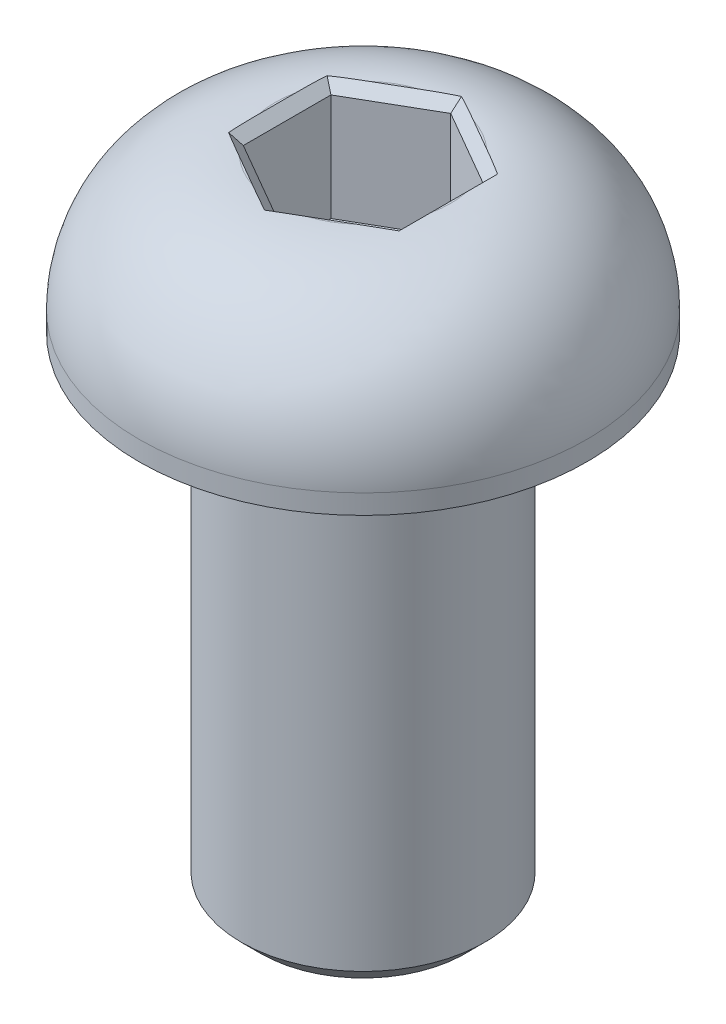
ISO-10303-21;
HEADER;
FILE_DESCRIPTION(('STEP AP214'),'2;1');
FILE_NAME('part.step','',(''),(''),'','','');
FILE_SCHEMA(('AUTOMOTIVE_DESIGN { 1 0 10303 214 1 1 1 1 }'));
ENDSEC;
DATA;
#1=APPLICATION_CONTEXT('core data for automotive mechanical design processes');
#2=APPLICATION_PROTOCOL_DEFINITION('international standard','automotive_design',2000,#1);
#3=PRODUCT_CONTEXT('',#1,'mechanical');
#4=PRODUCT('Part','Part','',(#3));
#5=PRODUCT_RELATED_PRODUCT_CATEGORY('part','',(#4));
#6=PRODUCT_DEFINITION_FORMATION('','',#4);
#7=PRODUCT_DEFINITION_CONTEXT('part definition',#1,'design');
#8=PRODUCT_DEFINITION('design','',#6,#7);
#9=PRODUCT_DEFINITION_SHAPE('','',#8);
#10=(LENGTH_UNIT() NAMED_UNIT(*) SI_UNIT(.MILLI.,.METRE.));
#11=(NAMED_UNIT(*) PLANE_ANGLE_UNIT() SI_UNIT($,.RADIAN.));
#12=(NAMED_UNIT(*) SI_UNIT($,.STERADIAN.) SOLID_ANGLE_UNIT());
#13=UNCERTAINTY_MEASURE_WITH_UNIT(LENGTH_MEASURE(1.E-05),#10,'distance_accuracy_value','');
#14=(GEOMETRIC_REPRESENTATION_CONTEXT(3) GLOBAL_UNCERTAINTY_ASSIGNED_CONTEXT((#13)) GLOBAL_UNIT_ASSIGNED_CONTEXT((#10,
#11,#12)) REPRESENTATION_CONTEXT('',''));
#15=CARTESIAN_POINT('',(0.,0.,0.));
#16=DIRECTION('',(0.,0.,1.));
#17=DIRECTION('',(1.,0.,0.));
#18=AXIS2_PLACEMENT_3D('',#15,#16,#17);
#19=CARTESIAN_POINT('',(2.23520000000001,0.,0.));
#20=DIRECTION('',(0.707106781186548,-0.707106781186548,0.));
#21=DIRECTION('',(0.707106781186548,0.707106781186548,0.));
#22=AXIS2_PLACEMENT_3D('',#19,#20,#21);
#23=PLANE('',#22);
#24=CARTESIAN_POINT('',(2.22399670617115,-0.0112032938288589,-1.28402509698474));
#25=CARTESIAN_POINT('',(2.22841135106006,-0.00678864893879202,-1.16554783242049));
#26=CARTESIAN_POINT('',(2.23110879962653,-0.00409120037287481,-1.04699639920592));
#27=CARTESIAN_POINT('',(2.23438345381033,-0.000816546190287566,-0.809850635730226));
#28=CARTESIAN_POINT('',(2.23496107929993,-0.000238920701353471,-0.691256318617618));
#29=CARTESIAN_POINT('',(2.23515898063711,-4.10193631359054E-05,-0.557099307855873));
#30=CARTESIAN_POINT('',(2.2351750070183,-2.49929817972814E-05,-0.541528977035806));
#31=CARTESIAN_POINT('',(2.23519554632668,-4.453673235457E-06,-0.510387894564967));
#32=CARTESIAN_POINT('',(2.23520005895435,5.89544553829237E-08,-0.494817142913786));
#33=CARTESIAN_POINT('',(2.23520000000001,0.,-0.479246241508439));
#34=B_SPLINE_CURVE_WITH_KNOTS('',3,(#24,#25,#26,#27,#28,#29,#30,#31,#32,#33),.UNSPECIFIED.,.F.,
.F.,(4,2,2,2,4),(0.,0.355828535544475,0.711586588509343,0.758297774785068,0.805010176248268),.UNSPECIFIED.);
#35=CARTESIAN_POINT('',(2.22399670617115,-0.0112032938288588,-1.28402509698474));
#36=VERTEX_POINT('',#35);
#37=CARTESIAN_POINT('',(2.23520000000001,0.,-0.479246241508439));
#38=VERTEX_POINT('',#37);
#39=EDGE_CURVE('E129',#36,#38,#34,.T.);
#40=ORIENTED_EDGE('',*,*,#39,.F.);
#41=DIRECTION('',(-0.654653670707975,-0.654653670707977,0.37796447300923));
#42=VECTOR('',#41,1.);
#43=CARTESIAN_POINT('',(2.22399670617115,-0.0112032938288602,-1.28402509698474));
#44=LINE('',#43,#42);
#45=CARTESIAN_POINT('',(1.98120000000001,-0.254,-1.14384635331848));
#46=VERTEX_POINT('',#45);
#47=EDGE_CURVE('E137',#36,#46,#44,.T.);
#48=ORIENTED_EDGE('',*,*,#47,.T.);
#49=DIRECTION('',(0.,0.,1.));
#50=VECTOR('',#49,1.);
#51=CARTESIAN_POINT('',(1.98120000000001,-0.254000000000001,-1.14384635331848));
#52=LINE('',#51,#50);
#53=CARTESIAN_POINT('',(1.98120000000001,-0.254000000000001,1.14384635331849));
#54=VERTEX_POINT('',#53);
#55=EDGE_CURVE('E224',#54,#46,#52,.F.);
#56=ORIENTED_EDGE('',*,*,#55,.F.);
#57=DIRECTION('',(0.654653670707976,0.654653670707977,0.377964473009229));
#58=VECTOR('',#57,1.);
#59=CARTESIAN_POINT('',(1.98120000000001,-0.254,1.14384635331849));
#60=LINE('',#59,#58);
#61=CARTESIAN_POINT('',(2.22399670617115,-0.0112032938288603,1.28402509698475));
#62=VERTEX_POINT('',#61);
#63=EDGE_CURVE('E187',#54,#62,#60,.T.);
#64=ORIENTED_EDGE('',*,*,#63,.T.);
#65=CARTESIAN_POINT('',(2.23520000000001,0.,0.479246241508439));
#66=CARTESIAN_POINT('',(2.23519208788843,-7.91211009480866E-06,0.597800715305684));
#67=CARTESIAN_POINT('',(2.23495349481257,-0.000246505186659069,0.716402395238539));
#68=CARTESIAN_POINT('',(2.23270241259373,-0.0024975874070557,0.953513904044191));
#69=CARTESIAN_POINT('',(2.23069069534341,-0.00450930465823549,1.0720237504285));
#70=CARTESIAN_POINT('',(2.2266687677988,-0.00853123220151168,1.20604578947156));
#71=CARTESIAN_POINT('',(2.22617387547318,-0.00902612452694535,1.22164382162402));
#72=CARTESIAN_POINT('',(2.22512799617112,-0.0100720038287759,1.25283701736964));
#73=CARTESIAN_POINT('',(2.22457700598046,-0.0106229940193991,1.26843218074709));
#74=CARTESIAN_POINT('',(2.22399670617115,-0.0112032938288599,1.28402509698475));
#75=B_SPLINE_CURVE_WITH_KNOTS('',3,(#65,#66,#67,#68,#69,#70,#71,#72,#73,#74),.UNSPECIFIED.,.F.,
.F.,(4,2,2,2,4),(0.,0.355743000096769,0.711331211340007,0.75817210537775,0.805015684759264),.UNSPECIFIED.);
#76=CARTESIAN_POINT('',(2.23520000000001,0.,0.479246241508439));
#77=VERTEX_POINT('',#76);
#78=EDGE_CURVE('E145',#77,#62,#75,.T.);
#79=ORIENTED_EDGE('',*,*,#78,.F.);
#80=DIRECTION('',(0.,0.,1.));
#81=VECTOR('',#80,1.);
#82=CARTESIAN_POINT('',(2.23520000000001,0.,0.));
#83=LINE('',#82,#81);
#84=EDGE_CURVE('E144',#38,#77,#83,.T.);
#85=ORIENTED_EDGE('',*,*,#84,.F.);
#86=EDGE_LOOP('',(#40,#48,#56,#64,#79,#85));
#87=FACE_BOUND('',#86,.T.);
#88=ADVANCED_FACE('F17',(#87),#23,.F.);
#89=CARTESIAN_POINT('',(1.1176,0.,1.93573998253899));
#90=DIRECTION('',(0.353553390593274,-0.707106781186548,0.612372435695794));
#91=DIRECTION('',(0.,-0.654653670707977,-0.755928946018455));
#92=AXIS2_PLACEMENT_3D('',#89,#90,#91);
#93=PLANE('',#92);
#94=CARTESIAN_POINT('',(0.70256058018549,0.,2.1753631032932));
#95=CARTESIAN_POINT('',(0.599885438088986,-7.91211009276454E-06,2.23463348810219));
#96=CARTESIAN_POINT('',(0.497054073797695,-0.000246505186657969,2.29372770040376));
#97=CARTESIAN_POINT('',(0.290583942532928,-0.00249758740705674,2.41033396041907));
#98=CARTESIAN_POINT('',(0.186945546340366,-0.00450930465823774,2.46784668536722));
#99=CARTESIAN_POINT('',(0.0688680920897798,-0.00853123220151213,2.53137461346293));
#100=CARTESIAN_POINT('',(0.0551123538338917,-0.00902612452694555,2.53874504021303));
#101=CARTESIAN_POINT('',(0.0275753142419301,-0.010072003828776,2.55343588004097));
#102=CARTESIAN_POINT('',(0.0137940114855596,-0.0106229940193992,2.56075629022735));
#103=CARTESIAN_POINT('',(0.,-0.0112032938288605,2.56805019396951));
#104=B_SPLINE_CURVE_WITH_KNOTS('',3,(#94,#95,#96,#97,#98,#99,#100,#101,#102,#103),.UNSPECIFIED.,
.F.,.F.,(4,2,2,2,4),(0.,0.35574300009677,0.711331211340008,0.758172105377752,0.805015684759268),.UNSPECIFIED.);
#105=CARTESIAN_POINT('',(0.70256058018549,0.,2.1753631032932));
#106=VERTEX_POINT('',#105);
#107=CARTESIAN_POINT('',(0.,-0.0112032938288596,2.5680501939695));
#108=VERTEX_POINT('',#107);
#109=EDGE_CURVE('E179',#106,#108,#104,.T.);
#110=ORIENTED_EDGE('',*,*,#109,.F.);
#111=DIRECTION('',(-0.866025403784439,0.,0.5));
#112=VECTOR('',#111,1.);
#113=CARTESIAN_POINT('',(1.53263941981452,0.,1.69611686178477));
#114=LINE('',#113,#112);
#115=CARTESIAN_POINT('',(1.53263941981452,0.,1.69611686178477));
#116=VERTEX_POINT('',#115);
#117=EDGE_CURVE('E182',#116,#106,#114,.T.);
#118=ORIENTED_EDGE('',*,*,#117,.F.);
#119=CARTESIAN_POINT('',(2.22399670617115,-0.01120329382886,1.28402509698475));
#120=CARTESIAN_POINT('',(2.12359970773207,-0.00678864893879016,1.34708692388936));
#121=CARTESIAN_POINT('',(2.02227987919643,-0.00409120037287398,1.40869869948061));
#122=CARTESIAN_POINT('',(1.81854295071853,-0.000816546190289203,1.53010751493024));
#123=CARTESIAN_POINT('',(1.71612607209935,-0.00023892070135656,1.58990491183442));
#124=CARTESIAN_POINT('',(1.60004164335248,-4.10193631366739E-05,1.65715480480073));
#125=CARTESIAN_POINT('',(1.58656535450756,-2.49929817977188E-05,1.664953849464));
#126=CARTESIAN_POINT('',(1.55960665564066,-4.4536732350329E-06,1.68054217826226));
#127=CARTESIAN_POINT('',(1.54612424546854,5.8954456337414E-08,1.68833146213805));
#128=CARTESIAN_POINT('',(1.53263941981452,0.,1.69611686178477));
#129=B_SPLINE_CURVE_WITH_KNOTS('',3,(#119,#120,#121,#122,#123,#124,#125,#126,#127,#128),
.UNSPECIFIED.,.F.,.F.,(4,2,2,2,4),(0.,0.355828535544475,0.711586588509342,0.758297774785077,
0.805010176248287),.UNSPECIFIED.);
#130=EDGE_CURVE('E184',#62,#116,#129,.T.);
#131=ORIENTED_EDGE('',*,*,#130,.F.);
#132=ORIENTED_EDGE('',*,*,#63,.F.);
#133=DIRECTION('',(-0.866025403784439,0.,0.5));
#134=VECTOR('',#133,1.);
#135=CARTESIAN_POINT('',(1.98120000000001,-0.254000000000001,1.14384635331849));
#136=LINE('',#135,#134);
#137=CARTESIAN_POINT('',(0.,-0.254000000000001,2.28769270663698));
#138=VERTEX_POINT('',#137);
#139=EDGE_CURVE('E226',#138,#54,#136,.F.);
#140=ORIENTED_EDGE('',*,*,#139,.F.);
#141=DIRECTION('',(0.,-0.654653670707977,-0.755928946018455));
#142=VECTOR('',#141,1.);
#143=CARTESIAN_POINT('',(0.,-0.319314285714288,2.21227426575883));
#144=LINE('',#143,#142);
#145=EDGE_CURVE('E176',#138,#108,#144,.F.);
#146=ORIENTED_EDGE('',*,*,#145,.T.);
#147=EDGE_LOOP('',(#110,#118,#131,#132,#140,#146));
#148=FACE_BOUND('',#147,.T.);
#149=ADVANCED_FACE('F484',(#148),#93,.F.);
#150=CARTESIAN_POINT('',(-1.1176,0.,1.93573998253898));
#151=DIRECTION('',(-0.353553390593274,-0.707106781186548,0.612372435695794));
#152=DIRECTION('',(0.,-0.654653670707977,-0.755928946018455));
#153=AXIS2_PLACEMENT_3D('',#150,#151,#152);
#154=PLANE('',#153);
#155=CARTESIAN_POINT('',(-1.53263941981454,0.,1.69611686178475));
#156=CARTESIAN_POINT('',(-1.63530664979946,-7.91211009375364E-06,1.6368327727965));
#157=CARTESIAN_POINT('',(-1.73789942101489,-0.000246505186658447,1.57732530516521));
#158=CARTESIAN_POINT('',(-1.94211847006083,-0.00249758740705628,1.45682005637487));
#159=CARTESIAN_POINT('',(-2.04374514900307,-0.00450930465823684,1.3958229349387));
#160=CARTESIAN_POINT('',(-2.15780067570904,-0.00853123220151208,1.32532882399136));
#161=CARTESIAN_POINT('',(-2.17106152163929,-0.0090261245269454,1.31710121858901));
#162=CARTESIAN_POINT('',(-2.19755268192919,-0.0100720038287754,1.30059886267133));
#163=CARTESIAN_POINT('',(-2.21078299449489,-0.0106229940193984,1.29232410948026));
#164=CARTESIAN_POINT('',(-2.22399670617113,-0.011203293828859,1.28402509698476));
#165=B_SPLINE_CURVE_WITH_KNOTS('',3,(#155,#156,#157,#158,#159,#160,#161,#162,#163,#164),
.UNSPECIFIED.,.F.,.F.,(4,2,2,2,4),(0.,0.35574300009677,0.711331211340009,0.758172105377731,
0.805015684759225),.UNSPECIFIED.);
#166=CARTESIAN_POINT('',(-1.53263941981454,0.,1.69611686178475));
#167=VERTEX_POINT('',#166);
#168=CARTESIAN_POINT('',(-2.22399670617113,-0.0112032938288591,1.28402509698476));
#169=VERTEX_POINT('',#168);
#170=EDGE_CURVE('E168',#167,#169,#165,.T.);
#171=ORIENTED_EDGE('',*,*,#170,.F.);
#172=DIRECTION('',(-0.866025403784439,0.,-0.499999999999999));
#173=VECTOR('',#172,1.);
#174=CARTESIAN_POINT('',(-0.702560580185463,0.,2.17536310329321));
#175=LINE('',#174,#173);
#176=CARTESIAN_POINT('',(-0.702560580185463,0.,2.17536310329321));
#177=VERTEX_POINT('',#176);
#178=EDGE_CURVE('E171',#177,#167,#175,.T.);
#179=ORIENTED_EDGE('',*,*,#178,.F.);
#180=CARTESIAN_POINT('',(0.,-0.0112032938288597,2.5680501939695));
#181=CARTESIAN_POINT('',(-0.104811643327982,-0.0067886489387911,2.51263475630986));
#182=CARTESIAN_POINT('',(-0.208828920430089,-0.00409120037287428,2.45569509868654));
#183=CARTESIAN_POINT('',(-0.415840503091795,-0.000816546190288205,2.33995815066047));
#184=CARTESIAN_POINT('',(-0.518835007200582,-0.000238920701354906,2.28116123045204));
#185=CARTESIAN_POINT('',(-0.635117337284623,-4.10193631363332E-05,2.21425411265661));
#186=CARTESIAN_POINT('',(-0.648609652510724,-2.49929817975634E-05,2.20648282649982));
#187=CARTESIAN_POINT('',(-0.675588890686008,-4.45367323519006E-06,2.19093007282723));
#188=CARTESIAN_POINT('',(-0.68907581348578,5.89544560530142E-08,2.18314860505184));
#189=CARTESIAN_POINT('',(-0.702560580185463,0.,2.17536310329321));
#190=B_SPLINE_CURVE_WITH_KNOTS('',3,(#180,#181,#182,#183,#184,#185,#186,#187,#188,#189),
.UNSPECIFIED.,.F.,.F.,(4,2,2,2,4),(0.,0.355828535544474,0.711586588509341,0.758297774785064,
0.805010176248262),.UNSPECIFIED.);
#191=EDGE_CURVE('E173',#108,#177,#190,.T.);
#192=ORIENTED_EDGE('',*,*,#191,.F.);
#193=ORIENTED_EDGE('',*,*,#145,.F.);
#194=DIRECTION('',(-0.866025403784439,0.,-0.5));
#195=VECTOR('',#194,1.);
#196=CARTESIAN_POINT('',(0.,-0.254000000000001,2.28769270663698));
#197=LINE('',#196,#195);
#198=CARTESIAN_POINT('',(-1.98119999999999,-0.254000000000001,1.14384635331849));
#199=VERTEX_POINT('',#198);
#200=EDGE_CURVE('E213',#199,#138,#197,.F.);
#201=ORIENTED_EDGE('',*,*,#200,.F.);
#202=DIRECTION('',(-0.654653670707976,0.654653670707976,0.377964473009232));
#203=VECTOR('',#202,1.);
#204=CARTESIAN_POINT('',(-1.98119999999999,-0.254,1.14384635331849));
#205=LINE('',#204,#203);
#206=EDGE_CURVE('E152',#199,#169,#205,.T.);
#207=ORIENTED_EDGE('',*,*,#206,.T.);
#208=EDGE_LOOP('',(#171,#179,#192,#193,#201,#207));
#209=FACE_BOUND('',#208,.T.);
#210=ADVANCED_FACE('F452',(#209),#154,.F.);
#211=CARTESIAN_POINT('',(1.1176,0.,-1.93573998253898));
#212=DIRECTION('',(0.353553390593273,-0.707106781186548,-0.612372435695794));
#213=DIRECTION('',(0.,0.654653670707977,-0.755928946018455));
#214=AXIS2_PLACEMENT_3D('',#211,#212,#213);
#215=PLANE('',#214);
#216=CARTESIAN_POINT('',(1.53263941981456,0.,-1.69611686178473));
#217=CARTESIAN_POINT('',(1.63530664979948,-7.91211009299081E-06,-1.63683277279648));
#218=CARTESIAN_POINT('',(1.73789942101491,-0.000246505186658079,-1.5773253051652));
#219=CARTESIAN_POINT('',(1.94211847006085,-0.0024975874070567,-1.45682005637485));
#220=CARTESIAN_POINT('',(2.04374514900309,-0.00450930465823765,-1.39582293493869));
#221=CARTESIAN_POINT('',(2.15780067570906,-0.00853123220151226,-1.32532882399135));
#222=CARTESIAN_POINT('',(2.17106152163931,-0.0090261245269455,-1.31710121858899));
#223=CARTESIAN_POINT('',(2.1975526819292,-0.0100720038287759,-1.30059886267131));
#224=CARTESIAN_POINT('',(2.21078299449491,-0.0106229940193993,-1.29232410948025));
#225=CARTESIAN_POINT('',(2.22399670617115,-0.0112032938288609,-1.28402509698475));
#226=B_SPLINE_CURVE_WITH_KNOTS('',3,(#216,#217,#218,#219,#220,#221,#222,#223,#224,#225),
.UNSPECIFIED.,.F.,.F.,(4,2,2,2,4),(0.,0.355743000096769,0.711331211340008,0.758172105377731,
0.805015684759225),.UNSPECIFIED.);
#227=CARTESIAN_POINT('',(1.53263941981456,0.,-1.69611686178473));
#228=VERTEX_POINT('',#227);
#229=EDGE_CURVE('E123',#228,#36,#226,.T.);
#230=ORIENTED_EDGE('',*,*,#229,.F.);
#231=DIRECTION('',(0.866025403784439,0.,0.499999999999999));
#232=VECTOR('',#231,1.);
#233=CARTESIAN_POINT('',(0.702560580185438,0.,-2.17536310329322));
#234=LINE('',#233,#232);
#235=CARTESIAN_POINT('',(0.702560580185438,0.,-2.17536310329322));
#236=VERTEX_POINT('',#235);
#237=EDGE_CURVE('E138',#236,#228,#234,.T.);
#238=ORIENTED_EDGE('',*,*,#237,.F.);
#239=CARTESIAN_POINT('',(0.,-0.0112032938288587,-2.56805019396949));
#240=CARTESIAN_POINT('',(0.104811643328,-0.00678864893879505,-2.51263475630986));
#241=CARTESIAN_POINT('',(0.208828920430105,-0.00409120037287619,-2.45569509868653));
#242=CARTESIAN_POINT('',(0.415840503091804,-0.000816546190285477,-2.33995815066046));
#243=CARTESIAN_POINT('',(0.518835007200587,-0.000238920701349571,-2.28116123045201));
#244=CARTESIAN_POINT('',(0.635117337284628,-4.10193631353533E-05,-2.21425411265659));
#245=CARTESIAN_POINT('',(0.648609652510723,-2.49929817972032E-05,-2.20648282649981));
#246=CARTESIAN_POINT('',(0.675588890685995,-4.45367323554173E-06,-2.19093007282724));
#247=CARTESIAN_POINT('',(0.689075813485762,5.89544556091054E-08,-2.18314860505184));
#248=CARTESIAN_POINT('',(0.702560580185438,0.,-2.17536310329322));
#249=B_SPLINE_CURVE_WITH_KNOTS('',3,(#239,#240,#241,#242,#243,#244,#245,#246,#247,#248),
.UNSPECIFIED.,.F.,.F.,(4,2,2,2,4),(0.,0.355828535544475,0.711586588509342,0.758297774785043,
0.80501017624822),.UNSPECIFIED.);
#250=CARTESIAN_POINT('',(0.,-0.0112032938288582,-2.56805019396949));
#251=VERTEX_POINT('',#250);
#252=EDGE_CURVE('E163',#251,#236,#249,.T.);
#253=ORIENTED_EDGE('',*,*,#252,.F.);
#254=DIRECTION('',(0.,0.654653670707977,-0.755928946018455));
#255=VECTOR('',#254,1.);
#256=CARTESIAN_POINT('',(0.,-0.319314285714283,-2.21227426575883));
#257=LINE('',#256,#255);
#258=CARTESIAN_POINT('',(0.,-0.254000000000001,-2.28769270663696));
#259=VERTEX_POINT('',#258);
#260=EDGE_CURVE('E166',#259,#251,#257,.T.);
#261=ORIENTED_EDGE('',*,*,#260,.F.);
#262=DIRECTION('',(0.866025403784439,0.,0.5));
#263=VECTOR('',#262,1.);
#264=CARTESIAN_POINT('',(0.,-0.254000000000001,-2.28769270663697));
#265=LINE('',#264,#263);
#266=EDGE_CURVE('E150',#46,#259,#265,.F.);
#267=ORIENTED_EDGE('',*,*,#266,.F.);
#268=ORIENTED_EDGE('',*,*,#47,.F.);
#269=EDGE_LOOP('',(#230,#238,#253,#261,#267,#268));
#270=FACE_BOUND('',#269,.T.);
#271=ADVANCED_FACE('F148',(#270),#215,.F.);
#272=CARTESIAN_POINT('',(-2.23519999999999,0.,0.));
#273=DIRECTION('',(-0.707106781186548,-0.707106781186548,0.));
#274=DIRECTION('',(0.707106781186548,-0.707106781186548,0.));
#275=AXIS2_PLACEMENT_3D('',#272,#273,#274);
#276=PLANE('',#275);
#277=CARTESIAN_POINT('',(-2.23519999999999,0.,-0.479246241508528));
#278=CARTESIAN_POINT('',(-2.2351920878884,-7.91211009243978E-06,-0.597800715305773));
#279=CARTESIAN_POINT('',(-2.23495349481255,-0.000246505186657994,-0.716402395238628));
#280=CARTESIAN_POINT('',(-2.23270241259371,-0.00249758740705764,-0.95351390404428));
#281=CARTESIAN_POINT('',(-2.23069069534339,-0.00450930465823917,-1.07202375042859));
#282=CARTESIAN_POINT('',(-2.22666876779878,-0.00853123220151316,-1.20604578947163));
#283=CARTESIAN_POINT('',(-2.22617387547316,-0.00902612452694601,-1.22164382162407));
#284=CARTESIAN_POINT('',(-2.2251279961711,-0.0100720038287753,-1.25283701736966));
#285=CARTESIAN_POINT('',(-2.22457700598044,-0.010622994019398,-1.2684321807471));
#286=CARTESIAN_POINT('',(-2.22399670617113,-0.0112032938288586,-1.28402509698474));
#287=B_SPLINE_CURVE_WITH_KNOTS('',3,(#277,#278,#279,#280,#281,#282,#283,#284,#285,#286),
.UNSPECIFIED.,.F.,.F.,(4,2,2,2,4),(0.,0.355743000096769,0.711331211340008,0.758172105377701,
0.805015684759166),.UNSPECIFIED.);
#288=CARTESIAN_POINT('',(-2.23519999999999,0.,-0.479246241508528));
#289=VERTEX_POINT('',#288);
#290=CARTESIAN_POINT('',(-2.22399670617113,-0.0112032938288586,-1.28402509698474));
#291=VERTEX_POINT('',#290);
#292=EDGE_CURVE('E417',#289,#291,#287,.T.);
#293=ORIENTED_EDGE('',*,*,#292,.F.);
#294=DIRECTION('',(0.,0.,1.));
#295=VECTOR('',#294,1.);
#296=CARTESIAN_POINT('',(-2.23519999999999,0.,0.));
#297=LINE('',#296,#295);
#298=CARTESIAN_POINT('',(-2.23519999999999,0.,0.479246241508528));
#299=VERTEX_POINT('',#298);
#300=EDGE_CURVE('E420',#299,#289,#297,.F.);
#301=ORIENTED_EDGE('',*,*,#300,.F.);
#302=CARTESIAN_POINT('',(-2.22399670617113,-0.0112032938288589,1.28402509698476));
#303=CARTESIAN_POINT('',(-2.22841135106005,-0.00678864893879358,1.16554783242051));
#304=CARTESIAN_POINT('',(-2.23110879962651,-0.00409120037287541,1.04699639920593));
#305=CARTESIAN_POINT('',(-2.2343834538103,-0.000816546190286238,0.809850635730243));
#306=CARTESIAN_POINT('',(-2.2349610792999,-0.000238920701351198,0.691256318617635));
#307=CARTESIAN_POINT('',(-2.23515898063709,-4.10193631354858E-05,0.557099307855903));
#308=CARTESIAN_POINT('',(-2.23517500701828,-2.49929817971261E-05,0.541528977035847));
#309=CARTESIAN_POINT('',(-2.23519554632667,-4.45367323561328E-06,0.510387894565033));
#310=CARTESIAN_POINT('',(-2.23520005895433,5.89544551794439E-08,0.494817142913863));
#311=CARTESIAN_POINT('',(-2.23519999999999,0.,0.479246241508528));
#312=B_SPLINE_CURVE_WITH_KNOTS('',3,(#302,#303,#304,#305,#306,#307,#308,#309,#310,#311),
.UNSPECIFIED.,.F.,.F.,(4,2,2,2,4),(0.,0.355828535544475,0.711586588509344,0.758297774785032,
0.805010176248196),.UNSPECIFIED.);
#313=EDGE_CURVE('E155',#169,#299,#312,.T.);
#314=ORIENTED_EDGE('',*,*,#313,.F.);
#315=ORIENTED_EDGE('',*,*,#206,.F.);
#316=DIRECTION('',(0.,0.,-1.));
#317=VECTOR('',#316,1.);
#318=CARTESIAN_POINT('',(-1.98119999999999,-0.254000000000001,1.14384635331849));
#319=LINE('',#318,#317);
#320=CARTESIAN_POINT('',(-1.98119999999999,-0.254,-1.14384635331848));
#321=VERTEX_POINT('',#320);
#322=EDGE_CURVE('E195',#321,#199,#319,.F.);
#323=ORIENTED_EDGE('',*,*,#322,.F.);
#324=DIRECTION('',(0.654653670707976,-0.654653670707976,0.377964473009232));
#325=VECTOR('',#324,1.);
#326=CARTESIAN_POINT('',(-2.22399670617113,-0.0112032938288584,-1.28402509698474));
#327=LINE('',#326,#325);
#328=EDGE_CURVE('E227',#291,#321,#327,.T.);
#329=ORIENTED_EDGE('',*,*,#328,.F.);
#330=EDGE_LOOP('',(#293,#301,#314,#315,#323,#329));
#331=FACE_BOUND('',#330,.T.);
#332=ADVANCED_FACE('F440',(#331),#276,.F.);
#333=CARTESIAN_POINT('',(1.98120000000001,-3.048,-1.14384635331848));
#334=DIRECTION('',(-1.,0.,0.));
#335=DIRECTION('',(0.,0.,1.));
#336=AXIS2_PLACEMENT_3D('',#333,#334,#335);
#337=PLANE('',#336);
#338=DIRECTION('',(0.,1.,0.));
#339=VECTOR('',#338,1.);
#340=CARTESIAN_POINT('',(1.98120000000001,-3.048,-1.14384635331848));
#341=LINE('',#340,#339);
#342=CARTESIAN_POINT('',(1.98120000000001,-3.048,-1.14384635331848));
#343=VERTEX_POINT('',#342);
#344=EDGE_CURVE('E231',#343,#46,#341,.T.);
#345=ORIENTED_EDGE('',*,*,#344,.F.);
#346=DIRECTION('',(0.,0.,-1.));
#347=VECTOR('',#346,1.);
#348=CARTESIAN_POINT('',(1.98120000000001,-3.048,0.));
#349=LINE('',#348,#347);
#350=CARTESIAN_POINT('',(1.98120000000001,-3.048,1.14384635331849));
#351=VERTEX_POINT('',#350);
#352=EDGE_CURVE('E410',#343,#351,#349,.F.);
#353=ORIENTED_EDGE('',*,*,#352,.T.);
#354=DIRECTION('',(0.,1.,0.));
#355=VECTOR('',#354,1.);
#356=CARTESIAN_POINT('',(1.98120000000001,-3.048,1.14384635331849));
#357=LINE('',#356,#355);
#358=EDGE_CURVE('E217',#54,#351,#357,.F.);
#359=ORIENTED_EDGE('',*,*,#358,.F.);
#360=ORIENTED_EDGE('',*,*,#55,.T.);
#361=EDGE_LOOP('',(#345,#353,#359,#360));
#362=FACE_BOUND('',#361,.T.);
#363=ADVANCED_FACE('F445',(#362),#337,.T.);
#364=CARTESIAN_POINT('',(1.98120000000001,-3.048,1.14384635331849));
#365=DIRECTION('',(-0.5,0.,-0.866025403784439));
#366=DIRECTION('',(-0.866025403784439,0.,0.5));
#367=AXIS2_PLACEMENT_3D('',#364,#365,#366);
#368=PLANE('',#367);
#369=ORIENTED_EDGE('',*,*,#358,.T.);
#370=DIRECTION('',(-0.866025403784439,0.,0.5));
#371=VECTOR('',#370,1.);
#372=CARTESIAN_POINT('',(1.98120000000001,-3.048,1.14384635331849));
#373=LINE('',#372,#371);
#374=CARTESIAN_POINT('',(0.,-3.048,2.28769270663698));
#375=VERTEX_POINT('',#374);
#376=EDGE_CURVE('E408',#351,#375,#373,.T.);
#377=ORIENTED_EDGE('',*,*,#376,.T.);
#378=DIRECTION('',(0.,1.,0.));
#379=VECTOR('',#378,1.);
#380=CARTESIAN_POINT('',(0.,-3.048,2.28769270663698));
#381=LINE('',#380,#379);
#382=EDGE_CURVE('E216',#138,#375,#381,.F.);
#383=ORIENTED_EDGE('',*,*,#382,.F.);
#384=ORIENTED_EDGE('',*,*,#139,.T.);
#385=EDGE_LOOP('',(#369,#377,#383,#384));
#386=FACE_BOUND('',#385,.T.);
#387=ADVANCED_FACE('F690',(#386),#368,.T.);
#388=CARTESIAN_POINT('',(0.,-3.048,2.28769270663698));
#389=DIRECTION('',(0.5,0.,-0.866025403784439));
#390=DIRECTION('',(-0.866025403784439,0.,-0.5));
#391=AXIS2_PLACEMENT_3D('',#388,#389,#390);
#392=PLANE('',#391);
#393=ORIENTED_EDGE('',*,*,#382,.T.);
#394=DIRECTION('',(-0.866025403784438,0.,-0.500000000000001));
#395=VECTOR('',#394,1.);
#396=CARTESIAN_POINT('',(0.,-3.048,2.28769270663698));
#397=LINE('',#396,#395);
#398=CARTESIAN_POINT('',(-1.98119999999999,-3.048,1.14384635331849));
#399=VERTEX_POINT('',#398);
#400=EDGE_CURVE('E239',#375,#399,#397,.T.);
#401=ORIENTED_EDGE('',*,*,#400,.T.);
#402=DIRECTION('',(0.,1.,0.));
#403=VECTOR('',#402,1.);
#404=CARTESIAN_POINT('',(-1.98119999999999,-3.048,1.14384635331849));
#405=LINE('',#404,#403);
#406=EDGE_CURVE('E198',#199,#399,#405,.F.);
#407=ORIENTED_EDGE('',*,*,#406,.F.);
#408=ORIENTED_EDGE('',*,*,#200,.T.);
#409=EDGE_LOOP('',(#393,#401,#407,#408));
#410=FACE_BOUND('',#409,.T.);
#411=ADVANCED_FACE('F680',(#410),#392,.T.);
#412=CARTESIAN_POINT('',(0.,-3.048,-2.28769270663697));
#413=DIRECTION('',(-0.5,0.,0.866025403784439));
#414=DIRECTION('',(0.866025403784439,0.,0.5));
#415=AXIS2_PLACEMENT_3D('',#412,#413,#414);
#416=PLANE('',#415);
#417=DIRECTION('',(0.,1.,0.));
#418=VECTOR('',#417,1.);
#419=CARTESIAN_POINT('',(0.,-3.048,-2.28769270663697));
#420=LINE('',#419,#418);
#421=CARTESIAN_POINT('',(0.,-3.048,-2.28769270663697));
#422=VERTEX_POINT('',#421);
#423=EDGE_CURVE('E205',#422,#259,#420,.T.);
#424=ORIENTED_EDGE('',*,*,#423,.F.);
#425=DIRECTION('',(0.866025403784439,0.,0.5));
#426=VECTOR('',#425,1.);
#427=CARTESIAN_POINT('',(0.,-3.048,-2.28769270663697));
#428=LINE('',#427,#426);
#429=EDGE_CURVE('E412',#422,#343,#428,.T.);
#430=ORIENTED_EDGE('',*,*,#429,.T.);
#431=ORIENTED_EDGE('',*,*,#344,.T.);
#432=ORIENTED_EDGE('',*,*,#266,.T.);
#433=EDGE_LOOP('',(#424,#430,#431,#432));
#434=FACE_BOUND('',#433,.T.);
#435=ADVANCED_FACE('F670',(#434),#416,.T.);
#436=CARTESIAN_POINT('',(-1.98119999999999,-3.048,1.14384635331849));
#437=DIRECTION('',(1.,0.,0.));
#438=DIRECTION('',(0.,0.,-1.));
#439=AXIS2_PLACEMENT_3D('',#436,#437,#438);
#440=PLANE('',#439);
#441=ORIENTED_EDGE('',*,*,#406,.T.);
#442=DIRECTION('',(0.,0.,-1.));
#443=VECTOR('',#442,1.);
#444=CARTESIAN_POINT('',(-1.98119999999999,-3.048,0.));
#445=LINE('',#444,#443);
#446=CARTESIAN_POINT('',(-1.98119999999999,-3.048,-1.14384635331848));
#447=VERTEX_POINT('',#446);
#448=EDGE_CURVE('E221',#399,#447,#445,.T.);
#449=ORIENTED_EDGE('',*,*,#448,.T.);
#450=DIRECTION('',(0.,1.,0.));
#451=VECTOR('',#450,1.);
#452=CARTESIAN_POINT('',(-1.98119999999999,-3.048,-1.14384635331848));
#453=LINE('',#452,#451);
#454=EDGE_CURVE('E201',#321,#447,#453,.F.);
#455=ORIENTED_EDGE('',*,*,#454,.F.);
#456=ORIENTED_EDGE('',*,*,#322,.T.);
#457=EDGE_LOOP('',(#441,#449,#455,#456));
#458=FACE_BOUND('',#457,.T.);
#459=ADVANCED_FACE('F660',(#458),#440,.T.);
#460=CARTESIAN_POINT('',(-3.96239999999999,-3.048,0.));
#461=DIRECTION('',(0.,-1.,0.));
#462=DIRECTION('',(0.,0.,-1.));
#463=AXIS2_PLACEMENT_3D('',#460,#461,#462);
#464=PLANE('',#463);
#465=ORIENTED_EDGE('',*,*,#376,.F.);
#466=ORIENTED_EDGE('',*,*,#352,.F.);
#467=ORIENTED_EDGE('',*,*,#429,.F.);
#468=DIRECTION('',(0.866025403784439,0.,-0.5));
#469=VECTOR('',#468,1.);
#470=CARTESIAN_POINT('',(-1.98119999999999,-3.048,-1.14384635331848));
#471=LINE('',#470,#469);
#472=EDGE_CURVE('E204',#447,#422,#471,.T.);
#473=ORIENTED_EDGE('',*,*,#472,.F.);
#474=ORIENTED_EDGE('',*,*,#448,.F.);
#475=ORIENTED_EDGE('',*,*,#400,.F.);
#476=EDGE_LOOP('',(#465,#466,#467,#473,#474,#475));
#477=FACE_BOUND('',#476,.T.);
#478=ADVANCED_FACE('F651',(#477),#464,.F.);
#479=CARTESIAN_POINT('',(-1.98119999999999,-3.048,-1.14384635331848));
#480=DIRECTION('',(0.5,0.,0.866025403784439));
#481=DIRECTION('',(0.866025403784439,0.,-0.5));
#482=AXIS2_PLACEMENT_3D('',#479,#480,#481);
#483=PLANE('',#482);
#484=ORIENTED_EDGE('',*,*,#454,.T.);
#485=ORIENTED_EDGE('',*,*,#472,.T.);
#486=ORIENTED_EDGE('',*,*,#423,.T.);
#487=DIRECTION('',(-0.866025403784438,0.,0.5));
#488=VECTOR('',#487,1.);
#489=CARTESIAN_POINT('',(0.,-0.254000000000001,-2.28769270663696));
#490=LINE('',#489,#488);
#491=EDGE_CURVE('E208',#259,#321,#490,.T.);
#492=ORIENTED_EDGE('',*,*,#491,.T.);
#493=EDGE_LOOP('',(#484,#485,#486,#492));
#494=FACE_BOUND('',#493,.T.);
#495=ADVANCED_FACE('F643',(#494),#483,.T.);
#496=CARTESIAN_POINT('',(0.,0.,0.));
#497=DIRECTION('',(0.,1.,0.));
#498=DIRECTION('',(0.,0.,1.));
#499=AXIS2_PLACEMENT_3D('',#496,#497,#498);
#500=PLANE('',#499);
#501=ORIENTED_EDGE('',*,*,#178,.T.);
#502=CARTESIAN_POINT('',(0.,0.,0.));
#503=DIRECTION('',(0.,-1.,0.));
#504=DIRECTION('',(-0.307331837351471,0.,0.951602407389856));
#505=AXIS2_PLACEMENT_3D('',#502,#503,#504);
#506=CIRCLE('',#505,2.286);
#507=EDGE_CURVE('E355',#177,#167,#506,.T.);
#508=ORIENTED_EDGE('',*,*,#507,.F.);
#509=EDGE_LOOP('',(#501,#508));
#510=FACE_BOUND('',#509,.T.);
#511=ADVANCED_FACE('F379',(#510),#500,.T.);
#512=CARTESIAN_POINT('',(0.,0.,0.));
#513=DIRECTION('',(0.,1.,0.));
#514=DIRECTION('',(0.,0.,1.));
#515=AXIS2_PLACEMENT_3D('',#512,#513,#514);
#516=PLANE('',#515);
#517=ORIENTED_EDGE('',*,*,#300,.T.);
#518=CARTESIAN_POINT('',(0.,0.,0.));
#519=DIRECTION('',(0.,-1.,0.));
#520=DIRECTION('',(-0.977777777777773,0.,0.209644025156836));
#521=AXIS2_PLACEMENT_3D('',#518,#519,#520);
#522=CIRCLE('',#521,2.286);
#523=EDGE_CURVE('E524',#299,#289,#522,.T.);
#524=ORIENTED_EDGE('',*,*,#523,.F.);
#525=EDGE_LOOP('',(#517,#524));
#526=FACE_BOUND('',#525,.T.);
#527=ADVANCED_FACE('F375',(#526),#516,.T.);
#528=CARTESIAN_POINT('',(0.,0.,0.));
#529=DIRECTION('',(0.,1.,0.));
#530=DIRECTION('',(0.,0.,1.));
#531=AXIS2_PLACEMENT_3D('',#528,#529,#530);
#532=PLANE('',#531);
#533=DIRECTION('',(0.866025403784438,0.,-0.500000000000001));
#534=VECTOR('',#533,1.);
#535=CARTESIAN_POINT('',(-1.53263941981459,0.,-1.69611686178471));
#536=LINE('',#535,#534);
#537=CARTESIAN_POINT('',(-1.53263941981459,0.,-1.69611686178471));
#538=VERTEX_POINT('',#537);
#539=CARTESIAN_POINT('',(-0.702560580185403,0.,-2.17536310329323));
#540=VERTEX_POINT('',#539);
#541=EDGE_CURVE('E37',#538,#540,#536,.T.);
#542=ORIENTED_EDGE('',*,*,#541,.T.);
#543=CARTESIAN_POINT('',(0.,0.,0.));
#544=DIRECTION('',(0.,-1.,0.));
#545=DIRECTION('',(-0.670445940426328,0.,-0.741958382233031));
#546=AXIS2_PLACEMENT_3D('',#543,#544,#545);
#547=CIRCLE('',#546,2.286);
#548=EDGE_CURVE('E263',#538,#540,#547,.T.);
#549=ORIENTED_EDGE('',*,*,#548,.F.);
#550=EDGE_LOOP('',(#542,#549));
#551=FACE_BOUND('',#550,.T.);
#552=ADVANCED_FACE('F366',(#551),#532,.T.);
#553=CARTESIAN_POINT('',(-1.1176,0.,-1.93573998253897));
#554=DIRECTION('',(-0.353553390593274,-0.707106781186548,-0.612372435695794));
#555=DIRECTION('',(0.,0.654653670707977,-0.755928946018455));
#556=AXIS2_PLACEMENT_3D('',#553,#554,#555);
#557=PLANE('',#556);
#558=CARTESIAN_POINT('',(-0.702560580185403,0.,-2.17536310329323));
#559=CARTESIAN_POINT('',(-0.599885438088896,-7.91211008898561E-06,-2.23463348810221));
#560=CARTESIAN_POINT('',(-0.497054073797606,-0.000246505186656162,-2.29372770040379));
#561=CARTESIAN_POINT('',(-0.290583942532842,-0.00249758740705943,-2.4103339604191));
#562=CARTESIAN_POINT('',(-0.18694554634028,-0.00450930465824294,-2.46784668536725));
#563=CARTESIAN_POINT('',(-0.0688680920897044,-0.00853123220151371,-2.53137461346295));
#564=CARTESIAN_POINT('',(-0.0551123538338287,-0.00902612452694618,-2.53874504021305));
#565=CARTESIAN_POINT('',(-0.0275753142418927,-0.0100720038287753,-2.55343588004097));
#566=CARTESIAN_POINT('',(-0.0137940114855353,-0.0106229940193983,-2.56075629022734));
#567=CARTESIAN_POINT('',(0.,-0.01120329382886,-2.56805019396949));
#568=B_SPLINE_CURVE_WITH_KNOTS('',3,(#558,#559,#560,#561,#562,#563,#564,#565,#566,#567),
.UNSPECIFIED.,.F.,.F.,(4,2,2,2,4),(0.,0.35574300009677,0.711331211340009,0.75817210537771,
0.805015684759181),.UNSPECIFIED.);
#569=EDGE_CURVE('E261',#540,#251,#568,.T.);
#570=ORIENTED_EDGE('',*,*,#569,.F.);
#571=ORIENTED_EDGE('',*,*,#541,.F.);
#572=CARTESIAN_POINT('',(-2.22399670617113,-0.0112032938288587,-1.28402509698474));
#573=CARTESIAN_POINT('',(-2.12359970773206,-0.00678864893879357,-1.34708692388936));
#574=CARTESIAN_POINT('',(-2.02227987919641,-0.00409120037287536,-1.4086986994806));
#575=CARTESIAN_POINT('',(-1.81854295071851,-0.000816546190286119,-1.53010751493022));
#576=CARTESIAN_POINT('',(-1.71612607209932,-0.000238920701351038,-1.58990491183439));
#577=CARTESIAN_POINT('',(-1.60004164335247,-4.10193631355803E-05,-1.6571548048007));
#578=CARTESIAN_POINT('',(-1.58656535450757,-2.49929817972551E-05,-1.66495384946397));
#579=CARTESIAN_POINT('',(-1.5596066556407,-4.45367323549205E-06,-1.68054217826222));
#580=CARTESIAN_POINT('',(-1.5461242454686,5.89544555853967E-08,-1.688331462138));
#581=CARTESIAN_POINT('',(-1.53263941981459,0.,-1.69611686178471));
#582=B_SPLINE_CURVE_WITH_KNOTS('',3,(#572,#573,#574,#575,#576,#577,#578,#579,#580,#581),
.UNSPECIFIED.,.F.,.F.,(4,2,2,2,4),(0.,0.355828535544475,0.711586588509343,0.758297774785028,
0.805010176248189),.UNSPECIFIED.);
#583=EDGE_CURVE('E271',#291,#538,#582,.T.);
#584=ORIENTED_EDGE('',*,*,#583,.F.);
#585=ORIENTED_EDGE('',*,*,#328,.T.);
#586=ORIENTED_EDGE('',*,*,#491,.F.);
#587=ORIENTED_EDGE('',*,*,#260,.T.);
#588=EDGE_LOOP('',(#570,#571,#584,#585,#586,#587));
#589=FACE_BOUND('',#588,.T.);
#590=ADVANCED_FACE('F273',(#589),#557,.F.);
#591=CARTESIAN_POINT('',(0.,0.,0.));
#592=DIRECTION('',(0.,1.,0.));
#593=DIRECTION('',(0.,0.,1.));
#594=AXIS2_PLACEMENT_3D('',#591,#592,#593);
#595=PLANE('',#594);
#596=ORIENTED_EDGE('',*,*,#237,.T.);
#597=CARTESIAN_POINT('',(0.,0.,0.));
#598=DIRECTION('',(0.,-1.,0.));
#599=DIRECTION('',(0.30733183735146,0.,-0.951602407389859));
#600=AXIS2_PLACEMENT_3D('',#597,#598,#599);
#601=CIRCLE('',#600,2.286);
#602=EDGE_CURVE('E132',#236,#228,#601,.T.);
#603=ORIENTED_EDGE('',*,*,#602,.F.);
#604=EDGE_LOOP('',(#596,#603));
#605=FACE_BOUND('',#604,.T.);
#606=ADVANCED_FACE('F332',(#605),#595,.T.);
#607=CARTESIAN_POINT('',(0.,0.,0.));
#608=DIRECTION('',(0.,1.,0.));
#609=DIRECTION('',(0.,0.,1.));
#610=AXIS2_PLACEMENT_3D('',#607,#608,#609);
#611=PLANE('',#610);
#612=ORIENTED_EDGE('',*,*,#84,.T.);
#613=CARTESIAN_POINT('',(0.,0.,0.));
#614=DIRECTION('',(0.,-1.,0.));
#615=DIRECTION('',(0.977777777777781,0.,-0.209644025156798));
#616=AXIS2_PLACEMENT_3D('',#613,#614,#615);
#617=CIRCLE('',#616,2.286);
#618=EDGE_CURVE('E319',#38,#77,#617,.T.);
#619=ORIENTED_EDGE('',*,*,#618,.F.);
#620=EDGE_LOOP('',(#612,#619));
#621=FACE_BOUND('',#620,.T.);
#622=ADVANCED_FACE('F324',(#621),#611,.T.);
#623=CARTESIAN_POINT('',(0.,0.,0.));
#624=DIRECTION('',(0.,1.,0.));
#625=DIRECTION('',(0.,0.,1.));
#626=AXIS2_PLACEMENT_3D('',#623,#624,#625);
#627=PLANE('',#626);
#628=ORIENTED_EDGE('',*,*,#117,.T.);
#629=CARTESIAN_POINT('',(0.,0.,0.));
#630=DIRECTION('',(0.,-1.,0.));
#631=DIRECTION('',(0.670445940426298,0.,0.741958382233058));
#632=AXIS2_PLACEMENT_3D('',#629,#630,#631);
#633=CIRCLE('',#632,2.286);
#634=EDGE_CURVE('E297',#116,#106,#633,.T.);
#635=ORIENTED_EDGE('',*,*,#634,.F.);
#636=EDGE_LOOP('',(#628,#635));
#637=FACE_BOUND('',#636,.T.);
#638=ADVANCED_FACE('F283',(#637),#627,.T.);
#639=CARTESIAN_POINT('',(0.,-3.556,2.286));
#640=DIRECTION('',(1.,0.,0.));
#641=DIRECTION('',(0.,0.,1.));
#642=AXIS2_PLACEMENT_3D('',#639,#640,#641);
#643=CIRCLE('',#642,3.556);
#644=TRIMMED_CURVE('',#643,(PARAMETER_VALUE(-2.26901880015746)),
(PARAMETER_VALUE(2.26901880015746)),.T.,.PARAMETER.);
#645=CARTESIAN_POINT('',(0.,-3.556,0.));
#646=DIRECTION('',(0.,1.,0.));
#647=AXIS1_PLACEMENT('',#645,#646);
#648=SURFACE_OF_REVOLUTION('',#644,#647);
#649=ORIENTED_EDGE('',*,*,#569,.T.);
#650=ORIENTED_EDGE('',*,*,#252,.T.);
#651=ORIENTED_EDGE('',*,*,#602,.T.);
#652=ORIENTED_EDGE('',*,*,#229,.T.);
#653=ORIENTED_EDGE('',*,*,#39,.T.);
#654=ORIENTED_EDGE('',*,*,#618,.T.);
#655=ORIENTED_EDGE('',*,*,#78,.T.);
#656=ORIENTED_EDGE('',*,*,#130,.T.);
#657=ORIENTED_EDGE('',*,*,#634,.T.);
#658=ORIENTED_EDGE('',*,*,#109,.T.);
#659=ORIENTED_EDGE('',*,*,#191,.T.);
#660=ORIENTED_EDGE('',*,*,#507,.T.);
#661=ORIENTED_EDGE('',*,*,#170,.T.);
#662=ORIENTED_EDGE('',*,*,#313,.T.);
#663=ORIENTED_EDGE('',*,*,#523,.T.);
#664=ORIENTED_EDGE('',*,*,#292,.T.);
#665=ORIENTED_EDGE('',*,*,#583,.T.);
#666=ORIENTED_EDGE('',*,*,#548,.T.);
#667=EDGE_LOOP('',(#649,#650,#651,#652,#653,#654,#655,#656,#657,#658,#659,#660,#661,#662,#663,
#664,#665,#666));
#668=FACE_BOUND('',#667,.T.);
#669=CARTESIAN_POINT('',(0.,-3.556,0.));
#670=DIRECTION('',(0.,1.,0.));
#671=DIRECTION('',(0.,0.,1.));
#672=AXIS2_PLACEMENT_3D('',#669,#670,#671);
#673=CIRCLE('',#672,5.842);
#674=CARTESIAN_POINT('',(0.,-3.556,5.842));
#675=VERTEX_POINT('',#674);
#676=EDGE_CURVE('E260',#675,#675,#673,.F.);
#677=ORIENTED_EDGE('',*,*,#676,.F.);
#678=EDGE_LOOP('',(#677));
#679=FACE_BOUND('',#678,.T.);
#680=ADVANCED_FACE('F126',(#668,#679),#648,.F.);
#681=CARTESIAN_POINT('',(0.,-16.764,0.));
#682=DIRECTION('',(0.,1.,0.));
#683=DIRECTION('',(0.,0.,1.));
#684=AXIS2_PLACEMENT_3D('',#681,#682,#683);
#685=PLANE('',#684);
#686=CARTESIAN_POINT('',(0.,-16.7640000000233,0.));
#687=DIRECTION('',(0.,1.,0.));
#688=DIRECTION('',(0.,0.,1.));
#689=AXIS2_PLACEMENT_3D('',#686,#687,#688);
#690=CIRCLE('',#689,2.66700000003084);
#691=CARTESIAN_POINT('',(0.,-16.7640000000233,2.66700000003084));
#692=VERTEX_POINT('',#691);
#693=EDGE_CURVE('E257',#692,#692,#690,.T.);
#694=ORIENTED_EDGE('',*,*,#693,.F.);
#695=EDGE_LOOP('',(#694));
#696=FACE_BOUND('',#695,.T.);
#697=ADVANCED_FACE('F551',(#696),#685,.F.);
#698=CARTESIAN_POINT('',(0.,-4.064,0.));
#699=DIRECTION('',(0.,1.,0.));
#700=DIRECTION('',(0.,0.,1.));
#701=AXIS2_PLACEMENT_3D('',#698,#699,#700);
#702=CYLINDRICAL_SURFACE('',#701,5.842);
#703=ORIENTED_EDGE('',*,*,#676,.T.);
#704=EDGE_LOOP('',(#703));
#705=FACE_BOUND('',#704,.T.);
#706=CARTESIAN_POINT('',(0.,-4.064,0.));
#707=DIRECTION('',(0.,1.,0.));
#708=DIRECTION('',(0.,0.,1.));
#709=AXIS2_PLACEMENT_3D('',#706,#707,#708);
#710=CIRCLE('',#709,5.842);
#711=CARTESIAN_POINT('',(0.,-4.064,5.842));
#712=VERTEX_POINT('',#711);
#713=EDGE_CURVE('E254',#712,#712,#710,.T.);
#714=ORIENTED_EDGE('',*,*,#713,.T.);
#715=EDGE_LOOP('',(#714));
#716=FACE_BOUND('',#715,.T.);
#717=ADVANCED_FACE('F547',(#705,#716),#702,.T.);
#718=CARTESIAN_POINT('',(0.,-16.2560000000553,0.));
#719=DIRECTION('',(0.,1.,0.));
#720=DIRECTION('',(0.,0.,1.));
#721=AXIS2_PLACEMENT_3D('',#718,#719,#720);
#722=CONICAL_SURFACE('',#721,3.17499999999882,0.785398163397448);
#723=CARTESIAN_POINT('',(0.,-16.256,0.));
#724=DIRECTION('',(0.,1.,0.));
#725=DIRECTION('',(0.,0.,1.));
#726=AXIS2_PLACEMENT_3D('',#723,#724,#725);
#727=CIRCLE('',#726,3.175);
#728=CARTESIAN_POINT('',(0.,-16.256,3.175));
#729=VERTEX_POINT('',#728);
#730=EDGE_CURVE('E29',#729,#729,#727,.T.);
#731=ORIENTED_EDGE('',*,*,#730,.F.);
#732=EDGE_LOOP('',(#731));
#733=FACE_BOUND('',#732,.T.);
#734=ORIENTED_EDGE('',*,*,#693,.T.);
#735=EDGE_LOOP('',(#734));
#736=FACE_BOUND('',#735,.T.);
#737=ADVANCED_FACE('F543',(#733,#736),#722,.T.);
#738=CARTESIAN_POINT('',(0.,-4.064,0.));
#739=DIRECTION('',(0.,1.,0.));
#740=DIRECTION('',(0.,0.,1.));
#741=AXIS2_PLACEMENT_3D('',#738,#739,#740);
#742=PLANE('',#741);
#743=ORIENTED_EDGE('',*,*,#713,.F.);
#744=EDGE_LOOP('',(#743));
#745=FACE_BOUND('',#744,.T.);
#746=CARTESIAN_POINT('',(0.,-4.064,0.));
#747=DIRECTION('',(0.,1.,0.));
#748=DIRECTION('',(0.,0.,1.));
#749=AXIS2_PLACEMENT_3D('',#746,#747,#748);
#750=CIRCLE('',#749,3.175);
#751=CARTESIAN_POINT('',(0.,-4.064,3.175));
#752=VERTEX_POINT('',#751);
#753=EDGE_CURVE('E11',#752,#752,#750,.F.);
#754=ORIENTED_EDGE('',*,*,#753,.F.);
#755=EDGE_LOOP('',(#754));
#756=FACE_BOUND('',#755,.T.);
#757=ADVANCED_FACE('F546',(#745,#756),#742,.F.);
#758=CARTESIAN_POINT('',(0.,-16.764,0.));
#759=DIRECTION('',(0.,1.,0.));
#760=DIRECTION('',(0.,0.,1.));
#761=AXIS2_PLACEMENT_3D('',#758,#759,#760);
#762=CYLINDRICAL_SURFACE('',#761,3.175);
#763=ORIENTED_EDGE('',*,*,#753,.T.);
#764=EDGE_LOOP('',(#763));
#765=FACE_BOUND('',#764,.T.);
#766=ORIENTED_EDGE('',*,*,#730,.T.);
#767=EDGE_LOOP('',(#766));
#768=FACE_BOUND('',#767,.T.);
#769=ADVANCED_FACE('F541',(#765,#768),#762,.T.);
#770=CLOSED_SHELL('',(#88,#149,#210,#271,#332,#363,#387,#411,#435,#459,#478,#495,#511,#527,#552,
#590,#606,#622,#638,#680,#697,#717,#737,#757,#769));
#771=MANIFOLD_SOLID_BREP('B1',#770);
#772=ADVANCED_BREP_SHAPE_REPRESENTATION('',(#18,#771),#14);
#773=SHAPE_DEFINITION_REPRESENTATION(#9,#772);
ENDSEC;
END-ISO-10303-21;
